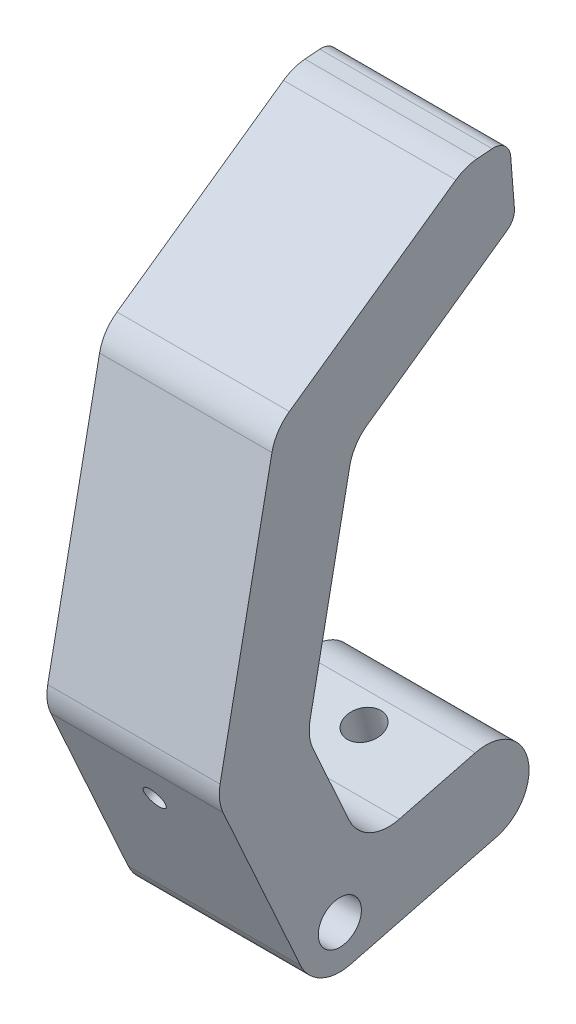
ISO-10303-21;
HEADER;
FILE_DESCRIPTION(('STEP AP214'),'2;1');
FILE_NAME('part.step','',(''),(''),'','','');
FILE_SCHEMA(('AUTOMOTIVE_DESIGN { 1 0 10303 214 1 1 1 1 }'));
ENDSEC;
DATA;
#1=APPLICATION_CONTEXT('core data for automotive mechanical design processes');
#2=APPLICATION_PROTOCOL_DEFINITION('international standard','automotive_design',2000,#1);
#3=PRODUCT_CONTEXT('',#1,'mechanical');
#4=PRODUCT('Part','Part','',(#3));
#5=PRODUCT_RELATED_PRODUCT_CATEGORY('part','',(#4));
#6=PRODUCT_DEFINITION_FORMATION('','',#4);
#7=PRODUCT_DEFINITION_CONTEXT('part definition',#1,'design');
#8=PRODUCT_DEFINITION('design','',#6,#7);
#9=PRODUCT_DEFINITION_SHAPE('','',#8);
#10=(LENGTH_UNIT() NAMED_UNIT(*) SI_UNIT(.MILLI.,.METRE.));
#11=(NAMED_UNIT(*) PLANE_ANGLE_UNIT() SI_UNIT($,.RADIAN.));
#12=(NAMED_UNIT(*) SI_UNIT($,.STERADIAN.) SOLID_ANGLE_UNIT());
#13=UNCERTAINTY_MEASURE_WITH_UNIT(LENGTH_MEASURE(1.E-05),#10,'distance_accuracy_value','');
#14=(GEOMETRIC_REPRESENTATION_CONTEXT(3) GLOBAL_UNCERTAINTY_ASSIGNED_CONTEXT((#13)) GLOBAL_UNIT_ASSIGNED_CONTEXT((#10,
#11,#12)) REPRESENTATION_CONTEXT('',''));
#15=CARTESIAN_POINT('',(0.,0.,0.));
#16=DIRECTION('',(0.,0.,1.));
#17=DIRECTION('',(1.,0.,0.));
#18=AXIS2_PLACEMENT_3D('',#15,#16,#17);
#19=CARTESIAN_POINT('',(25.4,5.50953305681122,-21.5312719200679));
#20=DIRECTION('',(-1.,0.,0.));
#21=DIRECTION('',(0.,0.,1.));
#22=AXIS2_PLACEMENT_3D('',#19,#20,#21);
#23=PLANE('',#22);
#24=DIRECTION('',(0.,0.576049485239196,-0.817414821590395));
#25=VECTOR('',#24,1.);
#26=CARTESIAN_POINT('',(25.4,59.9870548429553,-1.95777574126077));
#27=LINE('',#26,#25);
#28=CARTESIAN_POINT('',(25.4,61.4501161534959,-4.03386126998012));
#29=VERTEX_POINT('',#28);
#30=CARTESIAN_POINT('',(25.4,75.9797270873739,-24.6513943702173));
#31=VERTEX_POINT('',#30);
#32=EDGE_CURVE('E212',#29,#31,#27,.T.);
#33=ORIENTED_EDGE('',*,*,#32,.T.);
#34=CARTESIAN_POINT('',(25.4,78.0559607342135,-23.1882286777098));
#35=DIRECTION('',(-1.,0.,0.));
#36=DIRECTION('',(0.,0.,1.));
#37=AXIS2_PLACEMENT_3D('',#34,#35,#36);
#38=CIRCLE('',#37,2.54);
#39=CARTESIAN_POINT('',(25.4,78.256554040815,-25.720295486731));
#40=VERTEX_POINT('',#39);
#41=EDGE_CURVE('E43',#31,#40,#38,.F.);
#42=ORIENTED_EDGE('',*,*,#41,.T.);
#43=DIRECTION('',(0.,0.996876696465029,0.0789737427564998));
#44=VECTOR('',#43,1.);
#45=CARTESIAN_POINT('',(25.4,87.7059409529652,-24.971703956953));
#46=LINE('',#45,#44);
#47=CARTESIAN_POINT('',(25.4,85.1738741439439,-25.1722972635545));
#48=VERTEX_POINT('',#47);
#49=EDGE_CURVE('E214',#40,#48,#46,.T.);
#50=ORIENTED_EDGE('',*,*,#49,.T.);
#51=CARTESIAN_POINT('',(25.4,84.9732808373424,-22.6402304545333));
#52=DIRECTION('',(-1.,0.,0.));
#53=DIRECTION('',(0.,0.,1.));
#54=AXIS2_PLACEMENT_3D('',#51,#52,#53);
#55=CIRCLE('',#54,2.54);
#56=CARTESIAN_POINT('',(25.4,87.5053476463636,-22.4396371479318));
#57=VERTEX_POINT('',#56);
#58=EDGE_CURVE('E50',#48,#57,#55,.F.);
#59=ORIENTED_EDGE('',*,*,#58,.T.);
#60=DIRECTION('',(0.,-0.0789737427565126,0.996876696465028));
#61=VECTOR('',#60,1.);
#62=CARTESIAN_POINT('',(25.4,87.1947329229573,-18.5187823354987));
#63=LINE('',#62,#61);
#64=CARTESIAN_POINT('',(25.4,87.3321282448001,-20.2531080717218));
#65=VERTEX_POINT('',#64);
#66=EDGE_CURVE('E216',#57,#65,#63,.T.);
#67=ORIENTED_EDGE('',*,*,#66,.T.);
#68=CARTESIAN_POINT('',(25.4,81.0019612222472,-20.7545913382257));
#69=DIRECTION('',(-1.,0.,0.));
#70=DIRECTION('',(0.,0.,1.));
#71=AXIS2_PLACEMENT_3D('',#68,#69,#70);
#72=CIRCLE('',#71,6.35);
#73=CARTESIAN_POINT('',(25.4,86.1925453393462,-17.0966771069568));
#74=VERTEX_POINT('',#73);
#75=EDGE_CURVE('E273',#65,#74,#72,.F.);
#76=ORIENTED_EDGE('',*,*,#75,.T.);
#77=DIRECTION('',(0.,-0.576049485239196,0.817414821590395));
#78=VECTOR('',#77,1.);
#79=CARTESIAN_POINT('',(25.4,67.4421004560722,9.51022377871572));
#80=LINE('',#79,#78);
#81=CARTESIAN_POINT('',(25.4,68.9051617666128,7.43413824999637));
#82=VERTEX_POINT('',#81);
#83=EDGE_CURVE('E218',#74,#82,#80,.T.);
#84=ORIENTED_EDGE('',*,*,#83,.T.);
#85=CARTESIAN_POINT('',(25.4,63.7145776495138,3.77622401872748));
#86=DIRECTION('',(-1.,0.,0.));
#87=DIRECTION('',(0.,0.,1.));
#88=AXIS2_PLACEMENT_3D('',#85,#86,#87);
#89=CIRCLE('',#88,6.35);
#90=CARTESIAN_POINT('',(25.4,64.9508834683492,10.0047108271195));
#91=VERTEX_POINT('',#90);
#92=EDGE_CURVE('E271',#82,#91,#89,.F.);
#93=ORIENTED_EDGE('',*,*,#92,.T.);
#94=DIRECTION('',(0.,-0.980864064313706,0.19469382973787));
#95=VECTOR('',#94,1.);
#96=CARTESIAN_POINT('',(25.4,24.4602857181746,18.0417771558497));
#97=LINE('',#96,#95);
#98=CARTESIAN_POINT('',(25.4,26.4588349924865,17.6450807875227));
#99=VERTEX_POINT('',#98);
#100=EDGE_CURVE('E250',#91,#99,#97,.T.);
#101=ORIENTED_EDGE('',*,*,#100,.T.);
#102=CARTESIAN_POINT('',(25.4,25.222529173651,11.4165939791307));
#103=DIRECTION('',(-1.,0.,0.));
#104=DIRECTION('',(0.,0.,1.));
#105=AXIS2_PLACEMENT_3D('',#102,#103,#104);
#106=CIRCLE('',#105,6.35);
#107=CARTESIAN_POINT('',(25.4,22.6040443160522,17.2015777345553));
#108=VERTEX_POINT('',#107);
#109=EDGE_CURVE('E269',#99,#108,#106,.F.);
#110=ORIENTED_EDGE('',*,*,#109,.T.);
#111=DIRECTION('',(0.,-0.911021063846385,-0.412359820094297));
#112=VECTOR('',#111,1.);
#113=CARTESIAN_POINT('',(25.4,-7.47266259314206,3.58781407717012));
#114=LINE('',#113,#112);
#115=CARTESIAN_POINT('',(25.4,-2.61848485759879,5.78498375542454));
#116=VERTEX_POINT('',#115);
#117=EDGE_CURVE('E186',#108,#116,#114,.T.);
#118=ORIENTED_EDGE('',*,*,#117,.T.);
#119=CARTESIAN_POINT('',(25.4,0.,0.));
#120=DIRECTION('',(-1.,0.,0.));
#121=DIRECTION('',(0.,0.,1.));
#122=AXIS2_PLACEMENT_3D('',#119,#120,#121);
#123=CIRCLE('',#122,6.35);
#124=CARTESIAN_POINT('',(25.4,-6.15179197716226,-1.57415230194606));
#125=VERTEX_POINT('',#124);
#126=EDGE_CURVE('E182',#116,#125,#123,.F.);
#127=ORIENTED_EDGE('',*,*,#126,.T.);
#128=DIRECTION('',(0.,0.247898000306466,-0.968786138135788));
#129=VECTOR('',#128,1.);
#130=CARTESIAN_POINT('',(25.4,-7.47266259314206,3.58781407717012));
#131=LINE('',#130,#129);
#132=CARTESIAN_POINT('',(25.4,-0.642258920351035,-23.105424222014));
#133=VERTEX_POINT('',#132);
#134=EDGE_CURVE('E173',#125,#133,#131,.T.);
#135=ORIENTED_EDGE('',*,*,#134,.T.);
#136=CARTESIAN_POINT('',(25.4,5.50953305681122,-21.5312719200679));
#137=DIRECTION('',(1.,0.,0.));
#138=DIRECTION('',(0.,0.,1.));
#139=AXIS2_PLACEMENT_3D('',#136,#137,#138);
#140=CIRCLE('',#139,6.35);
#141=CARTESIAN_POINT('',(25.4,11.6613250339735,-19.9571196181218));
#142=VERTEX_POINT('',#141);
#143=EDGE_CURVE('E178',#133,#142,#140,.T.);
#144=ORIENTED_EDGE('',*,*,#143,.T.);
#145=DIRECTION('',(0.,-0.247898000306467,0.968786138135788));
#146=VECTOR('',#145,1.);
#147=CARTESIAN_POINT('',(25.4,7.47266259314206,-3.58781407717012));
#148=LINE('',#147,#146);
#149=CARTESIAN_POINT('',(25.4,8.79353320912186,-8.7497804562863));
#150=VERTEX_POINT('',#149);
#151=EDGE_CURVE('E201',#142,#150,#148,.T.);
#152=ORIENTED_EDGE('',*,*,#151,.T.);
#153=CARTESIAN_POINT('',(25.4,14.9453251862841,-7.17562815434024));
#154=DIRECTION('',(-1.,0.,0.));
#155=DIRECTION('',(0.,0.,1.));
#156=AXIS2_PLACEMENT_3D('',#153,#154,#155);
#157=CIRCLE('',#156,6.35);
#158=CARTESIAN_POINT('',(25.4,12.3268403286853,-1.39064439891569));
#159=VERTEX_POINT('',#158);
#160=EDGE_CURVE('E304',#150,#159,#157,.T.);
#161=ORIENTED_EDGE('',*,*,#160,.T.);
#162=DIRECTION('',(0.,0.911021063846385,0.412359820094297));
#163=VECTOR('',#162,1.);
#164=CARTESIAN_POINT('',(25.4,7.47266259314206,-3.58781407717012));
#165=LINE('',#164,#163);
#166=CARTESIAN_POINT('',(25.4,24.1285312270051,3.95121138111735));
#167=VERTEX_POINT('',#166);
#168=EDGE_CURVE('E203',#159,#167,#165,.T.);
#169=ORIENTED_EDGE('',*,*,#168,.T.);
#170=CARTESIAN_POINT('',(25.4,26.7470160846039,-1.83377237430719));
#171=DIRECTION('',(-1.,0.,0.));
#172=DIRECTION('',(0.,0.,1.));
#173=AXIS2_PLACEMENT_3D('',#170,#171,#172);
#174=CIRCLE('',#173,6.35);
#175=CARTESIAN_POINT('',(25.4,27.9833219034394,4.39471443408484));
#176=VERTEX_POINT('',#175);
#177=EDGE_CURVE('E308',#167,#176,#174,.T.);
#178=ORIENTED_EDGE('',*,*,#177,.T.);
#179=DIRECTION('',(0.,0.980864064313706,-0.19469382973787));
#180=VECTOR('',#179,1.);
#181=CARTESIAN_POINT('',(25.4,25.9847726291275,4.79141080241176));
#182=LINE('',#181,#180);
#183=CARTESIAN_POINT('',(25.4,57.4958378552323,-1.46328869285698));
#184=VERTEX_POINT('',#183);
#185=EDGE_CURVE('E209',#176,#184,#182,.T.);
#186=ORIENTED_EDGE('',*,*,#185,.T.);
#187=CARTESIAN_POINT('',(25.4,56.2595320363969,-7.69177550124901));
#188=DIRECTION('',(-1.,0.,0.));
#189=DIRECTION('',(0.,0.,1.));
#190=AXIS2_PLACEMENT_3D('',#187,#188,#189);
#191=CIRCLE('',#190,6.35);
#192=EDGE_CURVE('E312',#184,#29,#191,.T.);
#193=ORIENTED_EDGE('',*,*,#192,.T.);
#194=EDGE_LOOP('',(#33,#42,#50,#59,#67,#76,#84,#93,#101,#110,#118,#127,#135,#144,#152,#161,#169,
#178,#186,#193));
#195=FACE_BOUND('',#194,.T.);
#196=CARTESIAN_POINT('',(25.4,0.,0.));
#197=DIRECTION('',(1.,0.,0.));
#198=DIRECTION('',(0.,0.,-1.));
#199=AXIS2_PLACEMENT_3D('',#196,#197,#198);
#200=CIRCLE('',#199,3.175);
#201=CARTESIAN_POINT('',(25.4,0.,-3.175));
#202=VERTEX_POINT('',#201);
#203=EDGE_CURVE('E225',#202,#202,#200,.T.);
#204=ORIENTED_EDGE('',*,*,#203,.F.);
#205=EDGE_LOOP('',(#204));
#206=FACE_BOUND('',#205,.T.);
#207=ADVANCED_FACE('F35',(#195,#206),#23,.F.);
#208=CARTESIAN_POINT('',(0.,5.50953305681122,-21.5312719200679));
#209=DIRECTION('',(-1.,0.,0.));
#210=DIRECTION('',(0.,0.,1.));
#211=AXIS2_PLACEMENT_3D('',#208,#209,#210);
#212=PLANE('',#211);
#213=DIRECTION('',(0.,0.996876696465029,0.0789737427564998));
#214=VECTOR('',#213,1.);
#215=CARTESIAN_POINT('',(0.,87.7059409529652,-24.971703956953));
#216=LINE('',#215,#214);
#217=CARTESIAN_POINT('',(0.,78.256554040815,-25.720295486731));
#218=VERTEX_POINT('',#217);
#219=CARTESIAN_POINT('',(0.,85.1738741439439,-25.1722972635545));
#220=VERTEX_POINT('',#219);
#221=EDGE_CURVE('E242',#218,#220,#216,.T.);
#222=ORIENTED_EDGE('',*,*,#221,.F.);
#223=CARTESIAN_POINT('',(0.,78.0559607342135,-23.1882286777098));
#224=DIRECTION('',(-1.,0.,0.));
#225=DIRECTION('',(0.,0.,1.));
#226=AXIS2_PLACEMENT_3D('',#223,#224,#225);
#227=CIRCLE('',#226,2.54);
#228=CARTESIAN_POINT('',(0.,75.9797270873739,-24.6513943702173));
#229=VERTEX_POINT('',#228);
#230=EDGE_CURVE('E321',#218,#229,#227,.T.);
#231=ORIENTED_EDGE('',*,*,#230,.T.);
#232=DIRECTION('',(0.,0.576049485239196,-0.817414821590395));
#233=VECTOR('',#232,1.);
#234=CARTESIAN_POINT('',(0.,59.9870548429553,-1.95777574126077));
#235=LINE('',#234,#233);
#236=CARTESIAN_POINT('',(0.,61.4501161534959,-4.03386126998012));
#237=VERTEX_POINT('',#236);
#238=EDGE_CURVE('E240',#237,#229,#235,.T.);
#239=ORIENTED_EDGE('',*,*,#238,.F.);
#240=CARTESIAN_POINT('',(0.,56.2595320363969,-7.69177550124901));
#241=DIRECTION('',(-1.,0.,0.));
#242=DIRECTION('',(0.,0.,1.));
#243=AXIS2_PLACEMENT_3D('',#240,#241,#242);
#244=CIRCLE('',#243,6.35);
#245=CARTESIAN_POINT('',(0.,57.4958378552323,-1.46328869285698));
#246=VERTEX_POINT('',#245);
#247=EDGE_CURVE('E310',#237,#246,#244,.F.);
#248=ORIENTED_EDGE('',*,*,#247,.T.);
#249=DIRECTION('',(0.,0.980864064313706,-0.19469382973787));
#250=VECTOR('',#249,1.);
#251=CARTESIAN_POINT('',(0.,25.9847726291275,4.79141080241176));
#252=LINE('',#251,#250);
#253=CARTESIAN_POINT('',(0.,27.9833219034394,4.39471443408484));
#254=VERTEX_POINT('',#253);
#255=EDGE_CURVE('E237',#254,#246,#252,.T.);
#256=ORIENTED_EDGE('',*,*,#255,.F.);
#257=CARTESIAN_POINT('',(0.,26.7470160846039,-1.83377237430719));
#258=DIRECTION('',(-1.,0.,0.));
#259=DIRECTION('',(0.,0.,1.));
#260=AXIS2_PLACEMENT_3D('',#257,#258,#259);
#261=CIRCLE('',#260,6.35);
#262=CARTESIAN_POINT('',(0.,24.1285312270051,3.95121138111735));
#263=VERTEX_POINT('',#262);
#264=EDGE_CURVE('E306',#254,#263,#261,.F.);
#265=ORIENTED_EDGE('',*,*,#264,.T.);
#266=DIRECTION('',(0.,0.911021063846385,0.412359820094297));
#267=VECTOR('',#266,1.);
#268=CARTESIAN_POINT('',(0.,7.47266259314206,-3.58781407717012));
#269=LINE('',#268,#267);
#270=CARTESIAN_POINT('',(0.,12.3268403286853,-1.39064439891569));
#271=VERTEX_POINT('',#270);
#272=EDGE_CURVE('E234',#271,#263,#269,.T.);
#273=ORIENTED_EDGE('',*,*,#272,.F.);
#274=CARTESIAN_POINT('',(0.,14.9453251862841,-7.17562815434024));
#275=DIRECTION('',(-1.,0.,0.));
#276=DIRECTION('',(0.,0.,1.));
#277=AXIS2_PLACEMENT_3D('',#274,#275,#276);
#278=CIRCLE('',#277,6.35);
#279=CARTESIAN_POINT('',(0.,8.79353320912186,-8.7497804562863));
#280=VERTEX_POINT('',#279);
#281=EDGE_CURVE('E302',#271,#280,#278,.F.);
#282=ORIENTED_EDGE('',*,*,#281,.T.);
#283=DIRECTION('',(0.,-0.247898000306467,0.968786138135788));
#284=VECTOR('',#283,1.);
#285=CARTESIAN_POINT('',(0.,7.47266259314206,-3.58781407717012));
#286=LINE('',#285,#284);
#287=CARTESIAN_POINT('',(0.,11.6613250339735,-19.9571196181218));
#288=VERTEX_POINT('',#287);
#289=EDGE_CURVE('E231',#288,#280,#286,.T.);
#290=ORIENTED_EDGE('',*,*,#289,.F.);
#291=CARTESIAN_POINT('',(0.,5.50953305681122,-21.5312719200679));
#292=DIRECTION('',(1.,0.,0.));
#293=DIRECTION('',(0.,0.,1.));
#294=AXIS2_PLACEMENT_3D('',#291,#292,#293);
#295=CIRCLE('',#294,6.35);
#296=CARTESIAN_POINT('',(0.,-0.642258920351035,-23.105424222014));
#297=VERTEX_POINT('',#296);
#298=EDGE_CURVE('E229',#297,#288,#295,.T.);
#299=ORIENTED_EDGE('',*,*,#298,.F.);
#300=DIRECTION('',(0.,0.247898000306466,-0.968786138135788));
#301=VECTOR('',#300,1.);
#302=CARTESIAN_POINT('',(0.,-7.47266259314206,3.58781407717012));
#303=LINE('',#302,#301);
#304=CARTESIAN_POINT('',(0.,-6.15179197716226,-1.57415230194606));
#305=VERTEX_POINT('',#304);
#306=EDGE_CURVE('E192',#305,#297,#303,.T.);
#307=ORIENTED_EDGE('',*,*,#306,.F.);
#308=CARTESIAN_POINT('',(0.,0.,0.));
#309=DIRECTION('',(-1.,0.,0.));
#310=DIRECTION('',(0.,0.,1.));
#311=AXIS2_PLACEMENT_3D('',#308,#309,#310);
#312=CIRCLE('',#311,6.35);
#313=CARTESIAN_POINT('',(0.,-2.61848485759879,5.78498375542454));
#314=VERTEX_POINT('',#313);
#315=EDGE_CURVE('E256',#305,#314,#312,.T.);
#316=ORIENTED_EDGE('',*,*,#315,.T.);
#317=DIRECTION('',(0.,-0.911021063846385,-0.412359820094297));
#318=VECTOR('',#317,1.);
#319=CARTESIAN_POINT('',(0.,-7.47266259314206,3.58781407717012));
#320=LINE('',#319,#318);
#321=CARTESIAN_POINT('',(0.,22.6040443160522,17.2015777345553));
#322=VERTEX_POINT('',#321);
#323=EDGE_CURVE('E224',#322,#314,#320,.T.);
#324=ORIENTED_EDGE('',*,*,#323,.F.);
#325=CARTESIAN_POINT('',(0.,25.222529173651,11.4165939791307));
#326=DIRECTION('',(-1.,0.,0.));
#327=DIRECTION('',(0.,0.,1.));
#328=AXIS2_PLACEMENT_3D('',#325,#326,#327);
#329=CIRCLE('',#328,6.35);
#330=CARTESIAN_POINT('',(0.,26.4588349924865,17.6450807875227));
#331=VERTEX_POINT('',#330);
#332=EDGE_CURVE('E258',#322,#331,#329,.T.);
#333=ORIENTED_EDGE('',*,*,#332,.T.);
#334=DIRECTION('',(0.,-0.980864064313706,0.19469382973787));
#335=VECTOR('',#334,1.);
#336=CARTESIAN_POINT('',(0.,24.4602857181746,18.0417771558497));
#337=LINE('',#336,#335);
#338=CARTESIAN_POINT('',(0.,64.9508834683492,10.0047108271195));
#339=VERTEX_POINT('',#338);
#340=EDGE_CURVE('E221',#339,#331,#337,.T.);
#341=ORIENTED_EDGE('',*,*,#340,.F.);
#342=CARTESIAN_POINT('',(0.,63.7145776495138,3.77622401872748));
#343=DIRECTION('',(-1.,0.,0.));
#344=DIRECTION('',(0.,0.,1.));
#345=AXIS2_PLACEMENT_3D('',#342,#343,#344);
#346=CIRCLE('',#345,6.35);
#347=CARTESIAN_POINT('',(0.,68.9051617666128,7.43413824999637));
#348=VERTEX_POINT('',#347);
#349=EDGE_CURVE('E260',#339,#348,#346,.T.);
#350=ORIENTED_EDGE('',*,*,#349,.T.);
#351=DIRECTION('',(0.,-0.576049485239196,0.817414821590395));
#352=VECTOR('',#351,1.);
#353=CARTESIAN_POINT('',(0.,67.4421004560722,9.51022377871572));
#354=LINE('',#353,#352);
#355=CARTESIAN_POINT('',(0.,86.1925453393462,-17.0966771069568));
#356=VERTEX_POINT('',#355);
#357=EDGE_CURVE('E247',#356,#348,#354,.T.);
#358=ORIENTED_EDGE('',*,*,#357,.F.);
#359=CARTESIAN_POINT('',(0.,81.0019612222472,-20.7545913382257));
#360=DIRECTION('',(-1.,0.,0.));
#361=DIRECTION('',(0.,0.,1.));
#362=AXIS2_PLACEMENT_3D('',#359,#360,#361);
#363=CIRCLE('',#362,6.35);
#364=CARTESIAN_POINT('',(0.,87.3321282448001,-20.2531080717218));
#365=VERTEX_POINT('',#364);
#366=EDGE_CURVE('E262',#356,#365,#363,.T.);
#367=ORIENTED_EDGE('',*,*,#366,.T.);
#368=DIRECTION('',(0.,-0.0789737427565126,0.996876696465028));
#369=VECTOR('',#368,1.);
#370=CARTESIAN_POINT('',(0.,87.1947329229573,-18.5187823354987));
#371=LINE('',#370,#369);
#372=CARTESIAN_POINT('',(0.,87.5053476463636,-22.4396371479318));
#373=VERTEX_POINT('',#372);
#374=EDGE_CURVE('E245',#373,#365,#371,.T.);
#375=ORIENTED_EDGE('',*,*,#374,.F.);
#376=CARTESIAN_POINT('',(0.,84.9732808373424,-22.6402304545333));
#377=DIRECTION('',(-1.,0.,0.));
#378=DIRECTION('',(0.,0.,1.));
#379=AXIS2_PLACEMENT_3D('',#376,#377,#378);
#380=CIRCLE('',#379,2.54);
#381=EDGE_CURVE('E319',#373,#220,#380,.T.);
#382=ORIENTED_EDGE('',*,*,#381,.T.);
#383=EDGE_LOOP('',(#222,#231,#239,#248,#256,#265,#273,#282,#290,#299,#307,#316,#324,#333,#341,
#350,#358,#367,#375,#382));
#384=FACE_BOUND('',#383,.T.);
#385=CARTESIAN_POINT('',(0.,0.,0.));
#386=DIRECTION('',(1.,0.,0.));
#387=DIRECTION('',(0.,0.,-1.));
#388=AXIS2_PLACEMENT_3D('',#385,#386,#387);
#389=CIRCLE('',#388,3.175);
#390=CARTESIAN_POINT('',(0.,0.,-3.175));
#391=VERTEX_POINT('',#390);
#392=EDGE_CURVE('E611',#391,#391,#389,.T.);
#393=ORIENTED_EDGE('',*,*,#392,.T.);
#394=EDGE_LOOP('',(#393));
#395=FACE_BOUND('',#394,.T.);
#396=ADVANCED_FACE('F335',(#384,#395),#212,.T.);
#397=CARTESIAN_POINT('',(25.4,24.4602857181746,18.0417771558497));
#398=DIRECTION('',(0.,-0.19469382973787,-0.980864064313706));
#399=DIRECTION('',(0.,0.980864064313706,-0.19469382973787));
#400=AXIS2_PLACEMENT_3D('',#397,#398,#399);
#401=PLANE('',#400);
#402=ORIENTED_EDGE('',*,*,#100,.F.);
#403=DIRECTION('',(-1.,0.,0.));
#404=VECTOR('',#403,1.);
#405=CARTESIAN_POINT('',(25.4,64.9508834683492,10.0047108271195));
#406=LINE('',#405,#404);
#407=EDGE_CURVE('E292',#91,#339,#406,.T.);
#408=ORIENTED_EDGE('',*,*,#407,.T.);
#409=ORIENTED_EDGE('',*,*,#340,.T.);
#410=DIRECTION('',(-1.,0.,0.));
#411=VECTOR('',#410,1.);
#412=CARTESIAN_POINT('',(25.4,26.4588349924865,17.6450807875227));
#413=LINE('',#412,#411);
#414=EDGE_CURVE('E290',#331,#99,#413,.F.);
#415=ORIENTED_EDGE('',*,*,#414,.T.);
#416=EDGE_LOOP('',(#402,#408,#409,#415));
#417=FACE_BOUND('',#416,.T.);
#418=ADVANCED_FACE('F380',(#417),#401,.F.);
#419=CARTESIAN_POINT('',(25.4,-7.47266259314206,3.58781407717012));
#420=DIRECTION('',(0.,0.412359820094297,-0.911021063846385));
#421=DIRECTION('',(0.,0.911021063846385,0.412359820094297));
#422=AXIS2_PLACEMENT_3D('',#419,#420,#421);
#423=PLANE('',#422);
#424=CARTESIAN_POINT('',(12.7,16.8190605606277,14.5830928769565));
#425=DIRECTION('',(0.,-0.412359820094297,0.911021063846385));
#426=DIRECTION('',(0.,-0.911021063846385,-0.412359820094297));
#427=AXIS2_PLACEMENT_3D('',#424,#425,#426);
#428=CIRCLE('',#427,1.5875);
#429=CARTESIAN_POINT('',(12.7,15.3728146217715,13.9284716625568));
#430=VERTEX_POINT('',#429);
#431=EDGE_CURVE('E625',#430,#430,#428,.T.);
#432=ORIENTED_EDGE('',*,*,#431,.F.);
#433=EDGE_LOOP('',(#432));
#434=FACE_BOUND('',#433,.T.);
#435=ORIENTED_EDGE('',*,*,#117,.F.);
#436=DIRECTION('',(-1.,0.,0.));
#437=VECTOR('',#436,1.);
#438=CARTESIAN_POINT('',(25.4,22.6040443160522,17.2015777345553));
#439=LINE('',#438,#437);
#440=EDGE_CURVE('E297',#108,#322,#439,.T.);
#441=ORIENTED_EDGE('',*,*,#440,.T.);
#442=ORIENTED_EDGE('',*,*,#323,.T.);
#443=DIRECTION('',(-1.,0.,0.));
#444=VECTOR('',#443,1.);
#445=CARTESIAN_POINT('',(25.4,-2.61848485759879,5.78498375542454));
#446=LINE('',#445,#444);
#447=EDGE_CURVE('E295',#314,#116,#446,.F.);
#448=ORIENTED_EDGE('',*,*,#447,.T.);
#449=EDGE_LOOP('',(#435,#441,#442,#448));
#450=FACE_BOUND('',#449,.T.);
#451=ADVANCED_FACE('F559',(#434,#450),#423,.F.);
#452=CARTESIAN_POINT('',(25.4,-7.47266259314206,3.58781407717012));
#453=DIRECTION('',(0.,0.968786138135789,0.247898000306467));
#454=DIRECTION('',(0.,-0.247898000306467,0.968786138135789));
#455=AXIS2_PLACEMENT_3D('',#452,#453,#454);
#456=PLANE('',#455);
#457=CARTESIAN_POINT('',(12.7,-1.58675030151869,-19.4143490357166));
#458=DIRECTION('',(0.,-0.968786138135789,-0.247898000306466));
#459=DIRECTION('',(0.,0.247898000306466,-0.968786138135789));
#460=AXIS2_PLACEMENT_3D('',#457,#458,#459);
#461=CIRCLE('',#460,2.54);
#462=CARTESIAN_POINT('',(12.7,-0.957089380740264,-21.8750658265815));
#463=VERTEX_POINT('',#462);
#464=EDGE_CURVE('E617',#463,#463,#461,.T.);
#465=ORIENTED_EDGE('',*,*,#464,.F.);
#466=EDGE_LOOP('',(#465));
#467=FACE_BOUND('',#466,.T.);
#468=ORIENTED_EDGE('',*,*,#134,.F.);
#469=DIRECTION('',(-1.,0.,0.));
#470=VECTOR('',#469,1.);
#471=CARTESIAN_POINT('',(25.4,-6.15179197716226,-1.57415230194606));
#472=LINE('',#471,#470);
#473=EDGE_CURVE('E300',#125,#305,#472,.T.);
#474=ORIENTED_EDGE('',*,*,#473,.T.);
#475=ORIENTED_EDGE('',*,*,#306,.T.);
#476=DIRECTION('',(-1.,0.,0.));
#477=VECTOR('',#476,1.);
#478=CARTESIAN_POINT('',(25.4,-0.642258920351035,-23.105424222014));
#479=LINE('',#478,#477);
#480=EDGE_CURVE('E189',#133,#297,#479,.T.);
#481=ORIENTED_EDGE('',*,*,#480,.F.);
#482=EDGE_LOOP('',(#468,#474,#475,#481));
#483=FACE_BOUND('',#482,.T.);
#484=ADVANCED_FACE('F190',(#467,#483),#456,.F.);
#485=CARTESIAN_POINT('',(25.4,5.50953305681122,-21.5312719200679));
#486=DIRECTION('',(-1.,0.,0.));
#487=DIRECTION('',(0.,0.,1.));
#488=AXIS2_PLACEMENT_3D('',#485,#486,#487);
#489=CYLINDRICAL_SURFACE('',#488,6.35);
#490=ORIENTED_EDGE('',*,*,#298,.T.);
#491=DIRECTION('',(-1.,0.,0.));
#492=VECTOR('',#491,1.);
#493=CARTESIAN_POINT('',(25.4,11.6613250339735,-19.9571196181218));
#494=LINE('',#493,#492);
#495=EDGE_CURVE('E196',#142,#288,#494,.T.);
#496=ORIENTED_EDGE('',*,*,#495,.F.);
#497=ORIENTED_EDGE('',*,*,#143,.F.);
#498=ORIENTED_EDGE('',*,*,#480,.T.);
#499=EDGE_LOOP('',(#490,#496,#497,#498));
#500=FACE_BOUND('',#499,.T.);
#501=ADVANCED_FACE('F198',(#500),#489,.T.);
#502=CARTESIAN_POINT('',(25.4,7.47266259314206,-3.58781407717012));
#503=DIRECTION('',(0.,-0.968786138135789,-0.247898000306467));
#504=DIRECTION('',(0.,0.247898000306467,-0.968786138135789));
#505=AXIS2_PLACEMENT_3D('',#502,#503,#504);
#506=PLANE('',#505);
#507=CARTESIAN_POINT('',(12.7,10.7168336528058,-16.2660444318245));
#508=DIRECTION('',(0.,-0.968786138135789,-0.247898000306467));
#509=DIRECTION('',(0.,0.247898000306467,-0.968786138135789));
#510=AXIS2_PLACEMENT_3D('',#507,#508,#509);
#511=CIRCLE('',#510,2.54);
#512=CARTESIAN_POINT('',(12.7,11.3464945735843,-18.7267612226894));
#513=VERTEX_POINT('',#512);
#514=EDGE_CURVE('E614',#513,#513,#511,.F.);
#515=ORIENTED_EDGE('',*,*,#514,.F.);
#516=EDGE_LOOP('',(#515));
#517=FACE_BOUND('',#516,.T.);
#518=ORIENTED_EDGE('',*,*,#289,.T.);
#519=DIRECTION('',(-1.,0.,0.));
#520=VECTOR('',#519,1.);
#521=CARTESIAN_POINT('',(25.4,8.79353320912186,-8.7497804562863));
#522=LINE('',#521,#520);
#523=EDGE_CURVE('E280',#280,#150,#522,.F.);
#524=ORIENTED_EDGE('',*,*,#523,.T.);
#525=ORIENTED_EDGE('',*,*,#151,.F.);
#526=ORIENTED_EDGE('',*,*,#495,.T.);
#527=EDGE_LOOP('',(#518,#524,#525,#526));
#528=FACE_BOUND('',#527,.T.);
#529=ADVANCED_FACE('F363',(#517,#528),#506,.F.);
#530=CARTESIAN_POINT('',(25.4,7.47266259314206,-3.58781407717012));
#531=DIRECTION('',(0.,-0.412359820094297,0.911021063846385));
#532=DIRECTION('',(0.,-0.911021063846385,-0.412359820094297));
#533=AXIS2_PLACEMENT_3D('',#530,#531,#532);
#534=PLANE('',#533);
#535=CARTESIAN_POINT('',(12.7,22.0560302758252,3.01312536610737));
#536=DIRECTION('',(0.,-0.412359820094297,0.911021063846385));
#537=DIRECTION('',(0.,-0.911021063846385,-0.412359820094297));
#538=AXIS2_PLACEMENT_3D('',#535,#536,#537);
#539=CIRCLE('',#538,1.5875);
#540=CARTESIAN_POINT('',(12.7,20.6097843369691,2.35850415170768));
#541=VERTEX_POINT('',#540);
#542=EDGE_CURVE('E620',#541,#541,#539,.F.);
#543=ORIENTED_EDGE('',*,*,#542,.F.);
#544=EDGE_LOOP('',(#543));
#545=FACE_BOUND('',#544,.T.);
#546=ORIENTED_EDGE('',*,*,#168,.F.);
#547=DIRECTION('',(-1.,0.,0.));
#548=VECTOR('',#547,1.);
#549=CARTESIAN_POINT('',(0.,12.3268403286853,-1.39064439891569));
#550=LINE('',#549,#548);
#551=EDGE_CURVE('E277',#159,#271,#550,.T.);
#552=ORIENTED_EDGE('',*,*,#551,.T.);
#553=ORIENTED_EDGE('',*,*,#272,.T.);
#554=DIRECTION('',(-1.,0.,0.));
#555=VECTOR('',#554,1.);
#556=CARTESIAN_POINT('',(25.4,24.1285312270051,3.95121138111735));
#557=LINE('',#556,#555);
#558=EDGE_CURVE('E275',#263,#167,#557,.F.);
#559=ORIENTED_EDGE('',*,*,#558,.T.);
#560=EDGE_LOOP('',(#546,#552,#553,#559));
#561=FACE_BOUND('',#560,.T.);
#562=ADVANCED_FACE('F355',(#545,#561),#534,.F.);
#563=CARTESIAN_POINT('',(25.4,25.9847726291275,4.79141080241176));
#564=DIRECTION('',(0.,0.19469382973787,0.980864064313706));
#565=DIRECTION('',(0.,-0.980864064313706,0.19469382973787));
#566=AXIS2_PLACEMENT_3D('',#563,#564,#565);
#567=PLANE('',#566);
#568=ORIENTED_EDGE('',*,*,#185,.F.);
#569=DIRECTION('',(-1.,0.,0.));
#570=VECTOR('',#569,1.);
#571=CARTESIAN_POINT('',(0.,27.9833219034394,4.39471443408484));
#572=LINE('',#571,#570);
#573=EDGE_CURVE('E284',#176,#254,#572,.T.);
#574=ORIENTED_EDGE('',*,*,#573,.T.);
#575=ORIENTED_EDGE('',*,*,#255,.T.);
#576=DIRECTION('',(-1.,0.,0.));
#577=VECTOR('',#576,1.);
#578=CARTESIAN_POINT('',(25.4,57.4958378552323,-1.46328869285698));
#579=LINE('',#578,#577);
#580=EDGE_CURVE('E282',#246,#184,#579,.F.);
#581=ORIENTED_EDGE('',*,*,#580,.T.);
#582=EDGE_LOOP('',(#568,#574,#575,#581));
#583=FACE_BOUND('',#582,.T.);
#584=ADVANCED_FACE('F346',(#583),#567,.F.);
#585=CARTESIAN_POINT('',(25.4,59.9870548429553,-1.95777574126077));
#586=DIRECTION('',(0.,0.817414821590395,0.576049485239196));
#587=DIRECTION('',(0.,-0.576049485239196,0.817414821590395));
#588=AXIS2_PLACEMENT_3D('',#585,#586,#587);
#589=PLANE('',#588);
#590=ORIENTED_EDGE('',*,*,#238,.T.);
#591=DIRECTION('',(-1.,0.,0.));
#592=VECTOR('',#591,1.);
#593=CARTESIAN_POINT('',(25.4,75.9797270873739,-24.6513943702173));
#594=LINE('',#593,#592);
#595=EDGE_CURVE('E58',#229,#31,#594,.F.);
#596=ORIENTED_EDGE('',*,*,#595,.T.);
#597=ORIENTED_EDGE('',*,*,#32,.F.);
#598=DIRECTION('',(-1.,0.,0.));
#599=VECTOR('',#598,1.);
#600=CARTESIAN_POINT('',(0.,61.4501161534959,-4.03386126998011));
#601=LINE('',#600,#599);
#602=EDGE_CURVE('E287',#29,#237,#601,.T.);
#603=ORIENTED_EDGE('',*,*,#602,.T.);
#604=EDGE_LOOP('',(#590,#596,#597,#603));
#605=FACE_BOUND('',#604,.T.);
#606=ADVANCED_FACE('F337',(#605),#589,.F.);
#607=CARTESIAN_POINT('',(25.4,87.7059409529652,-24.971703956953));
#608=DIRECTION('',(0.,-0.0789737427564998,0.996876696465029));
#609=DIRECTION('',(0.,-0.996876696465029,-0.0789737427564998));
#610=AXIS2_PLACEMENT_3D('',#607,#608,#609);
#611=PLANE('',#610);
#612=ORIENTED_EDGE('',*,*,#49,.F.);
#613=DIRECTION('',(-1.,0.,0.));
#614=VECTOR('',#613,1.);
#615=CARTESIAN_POINT('',(25.4,78.256554040815,-25.720295486731));
#616=LINE('',#615,#614);
#617=EDGE_CURVE('E316',#40,#218,#616,.T.);
#618=ORIENTED_EDGE('',*,*,#617,.T.);
#619=ORIENTED_EDGE('',*,*,#221,.T.);
#620=DIRECTION('',(-1.,0.,0.));
#621=VECTOR('',#620,1.);
#622=CARTESIAN_POINT('',(25.4,85.1738741439439,-25.1722972635545));
#623=LINE('',#622,#621);
#624=EDGE_CURVE('E314',#220,#48,#623,.F.);
#625=ORIENTED_EDGE('',*,*,#624,.T.);
#626=EDGE_LOOP('',(#612,#618,#619,#625));
#627=FACE_BOUND('',#626,.T.);
#628=ADVANCED_FACE('F329',(#627),#611,.F.);
#629=CARTESIAN_POINT('',(25.4,87.1947329229573,-18.5187823354987));
#630=DIRECTION('',(0.,-0.996876696465028,-0.0789737427565126));
#631=DIRECTION('',(0.,0.0789737427565126,-0.996876696465028));
#632=AXIS2_PLACEMENT_3D('',#629,#630,#631);
#633=PLANE('',#632);
#634=ORIENTED_EDGE('',*,*,#66,.F.);
#635=DIRECTION('',(-1.,0.,0.));
#636=VECTOR('',#635,1.);
#637=CARTESIAN_POINT('',(25.4,87.5053476463636,-22.4396371479318));
#638=LINE('',#637,#636);
#639=EDGE_CURVE('E11',#57,#373,#638,.T.);
#640=ORIENTED_EDGE('',*,*,#639,.T.);
#641=ORIENTED_EDGE('',*,*,#374,.T.);
#642=DIRECTION('',(-1.,0.,0.));
#643=VECTOR('',#642,1.);
#644=CARTESIAN_POINT('',(25.4,87.3321282448001,-20.2531080717218));
#645=LINE('',#644,#643);
#646=EDGE_CURVE('E265',#365,#65,#645,.F.);
#647=ORIENTED_EDGE('',*,*,#646,.T.);
#648=EDGE_LOOP('',(#634,#640,#641,#647));
#649=FACE_BOUND('',#648,.T.);
#650=ADVANCED_FACE('F389',(#649),#633,.F.);
#651=CARTESIAN_POINT('',(25.4,67.4421004560722,9.51022377871572));
#652=DIRECTION('',(0.,-0.817414821590395,-0.576049485239196));
#653=DIRECTION('',(0.,0.576049485239196,-0.817414821590395));
#654=AXIS2_PLACEMENT_3D('',#651,#652,#653);
#655=PLANE('',#654);
#656=ORIENTED_EDGE('',*,*,#83,.F.);
#657=DIRECTION('',(-1.,0.,0.));
#658=VECTOR('',#657,1.);
#659=CARTESIAN_POINT('',(25.4,86.1925453393462,-17.0966771069568));
#660=LINE('',#659,#658);
#661=EDGE_CURVE('E253',#74,#356,#660,.T.);
#662=ORIENTED_EDGE('',*,*,#661,.T.);
#663=ORIENTED_EDGE('',*,*,#357,.T.);
#664=DIRECTION('',(-1.,0.,0.));
#665=VECTOR('',#664,1.);
#666=CARTESIAN_POINT('',(25.4,68.9051617666128,7.43413824999637));
#667=LINE('',#666,#665);
#668=EDGE_CURVE('E195',#348,#82,#667,.F.);
#669=ORIENTED_EDGE('',*,*,#668,.T.);
#670=EDGE_LOOP('',(#656,#662,#663,#669));
#671=FACE_BOUND('',#670,.T.);
#672=ADVANCED_FACE('F386',(#671),#655,.F.);
#673=CARTESIAN_POINT('',(25.4,0.,0.));
#674=DIRECTION('',(-1.,0.,0.));
#675=DIRECTION('',(0.,0.,1.));
#676=AXIS2_PLACEMENT_3D('',#673,#674,#675);
#677=CYLINDRICAL_SURFACE('',#676,3.175);
#678=ORIENTED_EDGE('',*,*,#203,.T.);
#679=EDGE_LOOP('',(#678));
#680=FACE_BOUND('',#679,.T.);
#681=ORIENTED_EDGE('',*,*,#392,.F.);
#682=EDGE_LOOP('',(#681));
#683=FACE_BOUND('',#682,.T.);
#684=ADVANCED_FACE('F383',(#680,#683),#677,.F.);
#685=CARTESIAN_POINT('',(25.4,81.0019612222472,-20.7545913382257));
#686=DIRECTION('',(-1.,0.,0.));
#687=DIRECTION('',(0.,0.,1.));
#688=AXIS2_PLACEMENT_3D('',#685,#686,#687);
#689=CYLINDRICAL_SURFACE('',#688,6.35);
#690=ORIENTED_EDGE('',*,*,#75,.F.);
#691=ORIENTED_EDGE('',*,*,#646,.F.);
#692=ORIENTED_EDGE('',*,*,#366,.F.);
#693=ORIENTED_EDGE('',*,*,#661,.F.);
#694=EDGE_LOOP('',(#690,#691,#692,#693));
#695=FACE_BOUND('',#694,.T.);
#696=ADVANCED_FACE('F429',(#695),#689,.T.);
#697=CARTESIAN_POINT('',(25.4,14.9453251862841,-7.17562815434024));
#698=DIRECTION('',(1.,0.,0.));
#699=DIRECTION('',(0.,0.,-1.));
#700=AXIS2_PLACEMENT_3D('',#697,#698,#699);
#701=CYLINDRICAL_SURFACE('',#700,6.35);
#702=ORIENTED_EDGE('',*,*,#160,.F.);
#703=ORIENTED_EDGE('',*,*,#523,.F.);
#704=ORIENTED_EDGE('',*,*,#281,.F.);
#705=ORIENTED_EDGE('',*,*,#551,.F.);
#706=EDGE_LOOP('',(#702,#703,#704,#705));
#707=FACE_BOUND('',#706,.T.);
#708=ADVANCED_FACE('F359',(#707),#701,.F.);
#709=CARTESIAN_POINT('',(25.4,26.7470160846039,-1.83377237430719));
#710=DIRECTION('',(1.,0.,0.));
#711=DIRECTION('',(0.,0.,-1.));
#712=AXIS2_PLACEMENT_3D('',#709,#710,#711);
#713=CYLINDRICAL_SURFACE('',#712,6.35);
#714=ORIENTED_EDGE('',*,*,#177,.F.);
#715=ORIENTED_EDGE('',*,*,#558,.F.);
#716=ORIENTED_EDGE('',*,*,#264,.F.);
#717=ORIENTED_EDGE('',*,*,#573,.F.);
#718=EDGE_LOOP('',(#714,#715,#716,#717));
#719=FACE_BOUND('',#718,.T.);
#720=ADVANCED_FACE('F350',(#719),#713,.F.);
#721=CARTESIAN_POINT('',(25.4,56.2595320363969,-7.69177550124901));
#722=DIRECTION('',(1.,0.,0.));
#723=DIRECTION('',(0.,0.,-1.));
#724=AXIS2_PLACEMENT_3D('',#721,#722,#723);
#725=CYLINDRICAL_SURFACE('',#724,6.35);
#726=ORIENTED_EDGE('',*,*,#192,.F.);
#727=ORIENTED_EDGE('',*,*,#580,.F.);
#728=ORIENTED_EDGE('',*,*,#247,.F.);
#729=ORIENTED_EDGE('',*,*,#602,.F.);
#730=EDGE_LOOP('',(#726,#727,#728,#729));
#731=FACE_BOUND('',#730,.T.);
#732=ADVANCED_FACE('F341',(#731),#725,.F.);
#733=CARTESIAN_POINT('',(25.4,63.7145776495138,3.77622401872748));
#734=DIRECTION('',(-1.,0.,0.));
#735=DIRECTION('',(0.,0.,1.));
#736=AXIS2_PLACEMENT_3D('',#733,#734,#735);
#737=CYLINDRICAL_SURFACE('',#736,6.35);
#738=ORIENTED_EDGE('',*,*,#92,.F.);
#739=ORIENTED_EDGE('',*,*,#668,.F.);
#740=ORIENTED_EDGE('',*,*,#349,.F.);
#741=ORIENTED_EDGE('',*,*,#407,.F.);
#742=EDGE_LOOP('',(#738,#739,#740,#741));
#743=FACE_BOUND('',#742,.T.);
#744=ADVANCED_FACE('F455',(#743),#737,.T.);
#745=CARTESIAN_POINT('',(25.4,25.222529173651,11.4165939791307));
#746=DIRECTION('',(-1.,0.,0.));
#747=DIRECTION('',(0.,0.,1.));
#748=AXIS2_PLACEMENT_3D('',#745,#746,#747);
#749=CYLINDRICAL_SURFACE('',#748,6.35);
#750=ORIENTED_EDGE('',*,*,#109,.F.);
#751=ORIENTED_EDGE('',*,*,#414,.F.);
#752=ORIENTED_EDGE('',*,*,#332,.F.);
#753=ORIENTED_EDGE('',*,*,#440,.F.);
#754=EDGE_LOOP('',(#750,#751,#752,#753));
#755=FACE_BOUND('',#754,.T.);
#756=ADVANCED_FACE('F462',(#755),#749,.T.);
#757=CARTESIAN_POINT('',(25.4,0.,0.));
#758=DIRECTION('',(-1.,0.,0.));
#759=DIRECTION('',(0.,0.,1.));
#760=AXIS2_PLACEMENT_3D('',#757,#758,#759);
#761=CYLINDRICAL_SURFACE('',#760,6.35);
#762=ORIENTED_EDGE('',*,*,#126,.F.);
#763=ORIENTED_EDGE('',*,*,#447,.F.);
#764=ORIENTED_EDGE('',*,*,#315,.F.);
#765=ORIENTED_EDGE('',*,*,#473,.F.);
#766=EDGE_LOOP('',(#762,#763,#764,#765));
#767=FACE_BOUND('',#766,.T.);
#768=ADVANCED_FACE('F470',(#767),#761,.T.);
#769=CARTESIAN_POINT('',(12.7,91.1491592466085,4.31539443255727));
#770=DIRECTION('',(0.,-0.968786138135789,-0.247898000306466));
#771=DIRECTION('',(0.,0.247898000306466,-0.968786138135789));
#772=AXIS2_PLACEMENT_3D('',#769,#770,#771);
#773=CYLINDRICAL_SURFACE('',#772,2.54);
#774=ORIENTED_EDGE('',*,*,#464,.T.);
#775=EDGE_LOOP('',(#774));
#776=FACE_BOUND('',#775,.T.);
#777=ORIENTED_EDGE('',*,*,#514,.T.);
#778=EDGE_LOOP('',(#777));
#779=FACE_BOUND('',#778,.T.);
#780=ADVANCED_FACE('F478',(#776,#779),#773,.F.);
#781=CARTESIAN_POINT('',(12.7,44.8257789105328,-47.2917773277644));
#782=DIRECTION('',(0.,-0.412359820094297,0.911021063846385));
#783=DIRECTION('',(0.,-0.911021063846385,-0.412359820094297));
#784=AXIS2_PLACEMENT_3D('',#781,#782,#783);
#785=CYLINDRICAL_SURFACE('',#784,1.5875);
#786=ORIENTED_EDGE('',*,*,#431,.T.);
#787=EDGE_LOOP('',(#786));
#788=FACE_BOUND('',#787,.T.);
#789=ORIENTED_EDGE('',*,*,#542,.T.);
#790=EDGE_LOOP('',(#789));
#791=FACE_BOUND('',#790,.T.);
#792=ADVANCED_FACE('F487',(#788,#791),#785,.F.);
#793=CARTESIAN_POINT('',(25.4,78.0559607342135,-23.1882286777098));
#794=DIRECTION('',(-1.,0.,0.));
#795=DIRECTION('',(0.,0.,1.));
#796=AXIS2_PLACEMENT_3D('',#793,#794,#795);
#797=CYLINDRICAL_SURFACE('',#796,2.54);
#798=ORIENTED_EDGE('',*,*,#41,.F.);
#799=ORIENTED_EDGE('',*,*,#595,.F.);
#800=ORIENTED_EDGE('',*,*,#230,.F.);
#801=ORIENTED_EDGE('',*,*,#617,.F.);
#802=EDGE_LOOP('',(#798,#799,#800,#801));
#803=FACE_BOUND('',#802,.T.);
#804=ADVANCED_FACE('F332',(#803),#797,.T.);
#805=CARTESIAN_POINT('',(25.4,84.9732808373424,-22.6402304545333));
#806=DIRECTION('',(-1.,0.,0.));
#807=DIRECTION('',(0.,0.,1.));
#808=AXIS2_PLACEMENT_3D('',#805,#806,#807);
#809=CYLINDRICAL_SURFACE('',#808,2.54);
#810=ORIENTED_EDGE('',*,*,#58,.F.);
#811=ORIENTED_EDGE('',*,*,#624,.F.);
#812=ORIENTED_EDGE('',*,*,#381,.F.);
#813=ORIENTED_EDGE('',*,*,#639,.F.);
#814=EDGE_LOOP('',(#810,#811,#812,#813));
#815=FACE_BOUND('',#814,.T.);
#816=ADVANCED_FACE('F37',(#815),#809,.T.);
#817=CLOSED_SHELL('',(#207,#396,#418,#451,#484,#501,#529,#562,#584,#606,#628,#650,#672,#684,
#696,#708,#720,#732,#744,#756,#768,#780,#792,#804,#816));
#818=MANIFOLD_SOLID_BREP('B2',#817);
#819=ADVANCED_BREP_SHAPE_REPRESENTATION('',(#18,#818),#14);
#820=SHAPE_DEFINITION_REPRESENTATION(#9,#819);
ENDSEC;
END-ISO-10303-21;
